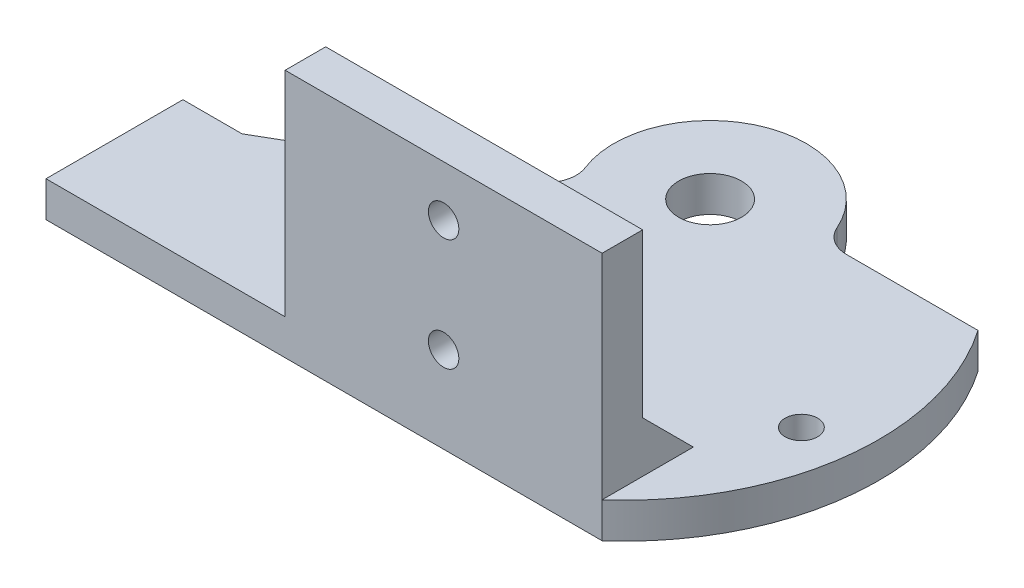
ISO-10303-21;
HEADER;
FILE_DESCRIPTION(('STEP AP214'),'2;1');
FILE_NAME('part.step','',(''),(''),'','','');
FILE_SCHEMA(('AUTOMOTIVE_DESIGN { 1 0 10303 214 1 1 1 1 }'));
ENDSEC;
DATA;
#1=APPLICATION_CONTEXT('core data for automotive mechanical design processes');
#2=APPLICATION_PROTOCOL_DEFINITION('international standard','automotive_design',2000,#1);
#3=PRODUCT_CONTEXT('',#1,'mechanical');
#4=PRODUCT('Part','Part','',(#3));
#5=PRODUCT_RELATED_PRODUCT_CATEGORY('part','',(#4));
#6=PRODUCT_DEFINITION_FORMATION('','',#4);
#7=PRODUCT_DEFINITION_CONTEXT('part definition',#1,'design');
#8=PRODUCT_DEFINITION('design','',#6,#7);
#9=PRODUCT_DEFINITION_SHAPE('','',#8);
#10=(LENGTH_UNIT() NAMED_UNIT(*) SI_UNIT(.MILLI.,.METRE.));
#11=(NAMED_UNIT(*) PLANE_ANGLE_UNIT() SI_UNIT($,.RADIAN.));
#12=(NAMED_UNIT(*) SI_UNIT($,.STERADIAN.) SOLID_ANGLE_UNIT());
#13=UNCERTAINTY_MEASURE_WITH_UNIT(LENGTH_MEASURE(1.E-05),#10,'distance_accuracy_value','');
#14=(GEOMETRIC_REPRESENTATION_CONTEXT(3) GLOBAL_UNCERTAINTY_ASSIGNED_CONTEXT((#13)) GLOBAL_UNIT_ASSIGNED_CONTEXT((#10,
#11,#12)) REPRESENTATION_CONTEXT('',''));
#15=CARTESIAN_POINT('',(0.,0.,0.));
#16=DIRECTION('',(0.,0.,1.));
#17=DIRECTION('',(1.,0.,0.));
#18=AXIS2_PLACEMENT_3D('',#15,#16,#17);
#19=CARTESIAN_POINT('',(20.3496,17.,13.5));
#20=DIRECTION('',(0.,0.,-1.));
#21=DIRECTION('',(1.,0.,0.));
#22=AXIS2_PLACEMENT_3D('',#19,#20,#21);
#23=PLANE('',#22);
#24=CARTESIAN_POINT('',(4.72198433686638,22.,13.5));
#25=DIRECTION('',(0.,0.,1.));
#26=DIRECTION('',(1.,0.,0.));
#27=AXIS2_PLACEMENT_3D('',#24,#25,#26);
#28=CIRCLE('',#27,1.5);
#29=CARTESIAN_POINT('',(6.22198433686639,22.,13.5));
#30=VERTEX_POINT('',#29);
#31=EDGE_CURVE('E361',#30,#30,#28,.T.);
#32=ORIENTED_EDGE('',*,*,#31,.F.);
#33=EDGE_LOOP('',(#32));
#34=FACE_BOUND('',#33,.T.);
#35=CARTESIAN_POINT('',(4.72198433686638,33.0559630595284,13.5));
#36=DIRECTION('',(0.,0.,1.));
#37=DIRECTION('',(1.,0.,0.));
#38=AXIS2_PLACEMENT_3D('',#35,#36,#37);
#39=CIRCLE('',#38,1.5);
#40=CARTESIAN_POINT('',(6.22198433686638,33.0559630595284,13.5));
#41=VERTEX_POINT('',#40);
#42=EDGE_CURVE('E351',#41,#41,#39,.T.);
#43=ORIENTED_EDGE('',*,*,#42,.F.);
#44=EDGE_LOOP('',(#43));
#45=FACE_BOUND('',#44,.T.);
#46=DIRECTION('',(1.,0.,0.));
#47=VECTOR('',#46,1.);
#48=CARTESIAN_POINT('',(20.3496,17.,13.5));
#49=LINE('',#48,#47);
#50=CARTESIAN_POINT('',(-34.4868,17.,13.5));
#51=VERTEX_POINT('',#50);
#52=CARTESIAN_POINT('',(-10.9056313262672,17.,13.5));
#53=VERTEX_POINT('',#52);
#54=EDGE_CURVE('E286',#51,#53,#49,.T.);
#55=ORIENTED_EDGE('',*,*,#54,.F.);
#56=DIRECTION('',(0.,-1.,0.));
#57=VECTOR('',#56,1.);
#58=CARTESIAN_POINT('',(-34.4868,17.,13.5));
#59=LINE('',#58,#57);
#60=CARTESIAN_POINT('',(-34.4868,13.5,13.5));
#61=VERTEX_POINT('',#60);
#62=EDGE_CURVE('E12',#51,#61,#59,.T.);
#63=ORIENTED_EDGE('',*,*,#62,.T.);
#64=DIRECTION('',(-1.,0.,0.));
#65=VECTOR('',#64,1.);
#66=CARTESIAN_POINT('',(20.3496,13.5,13.5));
#67=LINE('',#66,#65);
#68=CARTESIAN_POINT('',(20.3496,13.5,13.5));
#69=VERTEX_POINT('',#68);
#70=EDGE_CURVE('E172',#69,#61,#67,.T.);
#71=ORIENTED_EDGE('',*,*,#70,.F.);
#72=DIRECTION('',(0.,-1.,0.));
#73=VECTOR('',#72,1.);
#74=CARTESIAN_POINT('',(20.3496,17.,13.5));
#75=LINE('',#74,#73);
#76=CARTESIAN_POINT('',(20.3496,17.,13.5));
#77=VERTEX_POINT('',#76);
#78=EDGE_CURVE('E171',#77,#69,#75,.T.);
#79=ORIENTED_EDGE('',*,*,#78,.F.);
#80=DIRECTION('',(0.,-1.,0.));
#81=VECTOR('',#80,1.);
#82=CARTESIAN_POINT('',(20.3496,38.0559630595284,13.5));
#83=LINE('',#82,#81);
#84=CARTESIAN_POINT('',(20.3496,38.0559630595284,13.5));
#85=VERTEX_POINT('',#84);
#86=EDGE_CURVE('E318',#85,#77,#83,.T.);
#87=ORIENTED_EDGE('',*,*,#86,.F.);
#88=DIRECTION('',(1.,0.,0.));
#89=VECTOR('',#88,1.);
#90=CARTESIAN_POINT('',(-34.4868,38.0559630595284,13.5));
#91=LINE('',#90,#89);
#92=CARTESIAN_POINT('',(-10.9056313262672,38.0559630595284,13.5));
#93=VERTEX_POINT('',#92);
#94=EDGE_CURVE('E323',#93,#85,#91,.T.);
#95=ORIENTED_EDGE('',*,*,#94,.F.);
#96=DIRECTION('',(0.,1.,0.));
#97=VECTOR('',#96,1.);
#98=CARTESIAN_POINT('',(-10.9056313262672,17.,13.5));
#99=LINE('',#98,#97);
#100=EDGE_CURVE('E327',#53,#93,#99,.T.);
#101=ORIENTED_EDGE('',*,*,#100,.F.);
#102=EDGE_LOOP('',(#55,#63,#71,#79,#87,#95,#101));
#103=FACE_BOUND('',#102,.T.);
#104=ADVANCED_FACE('F35',(#34,#45,#103),#23,.F.);
#105=CARTESIAN_POINT('',(-34.4868,17.,13.5));
#106=DIRECTION('',(1.,0.,0.));
#107=DIRECTION('',(0.,0.,1.));
#108=AXIS2_PLACEMENT_3D('',#105,#106,#107);
#109=PLANE('',#108);
#110=DIRECTION('',(0.,0.,-1.));
#111=VECTOR('',#110,1.);
#112=CARTESIAN_POINT('',(-34.4868,17.,13.5));
#113=LINE('',#112,#111);
#114=CARTESIAN_POINT('',(-34.4868,17.,0.));
#115=VERTEX_POINT('',#114);
#116=EDGE_CURVE('E38',#51,#115,#113,.T.);
#117=ORIENTED_EDGE('',*,*,#116,.T.);
#118=DIRECTION('',(0.,-1.,0.));
#119=VECTOR('',#118,1.);
#120=CARTESIAN_POINT('',(-34.4868,17.,0.));
#121=LINE('',#120,#119);
#122=CARTESIAN_POINT('',(-34.4868,13.5,0.));
#123=VERTEX_POINT('',#122);
#124=EDGE_CURVE('E44',#115,#123,#121,.T.);
#125=ORIENTED_EDGE('',*,*,#124,.T.);
#126=DIRECTION('',(0.,0.,-1.));
#127=VECTOR('',#126,1.);
#128=CARTESIAN_POINT('',(-34.4868,13.5,13.5));
#129=LINE('',#128,#127);
#130=EDGE_CURVE('E174',#61,#123,#129,.T.);
#131=ORIENTED_EDGE('',*,*,#130,.F.);
#132=ORIENTED_EDGE('',*,*,#62,.F.);
#133=EDGE_LOOP('',(#117,#125,#131,#132));
#134=FACE_BOUND('',#133,.T.);
#135=ADVANCED_FACE('F280',(#134),#109,.F.);
#136=CARTESIAN_POINT('',(-34.4868,17.,0.));
#137=DIRECTION('',(0.,0.,1.));
#138=DIRECTION('',(-1.,0.,0.));
#139=AXIS2_PLACEMENT_3D('',#136,#137,#138);
#140=PLANE('',#139);
#141=DIRECTION('',(1.,0.,0.));
#142=VECTOR('',#141,1.);
#143=CARTESIAN_POINT('',(-34.4868,13.5,0.));
#144=LINE('',#143,#142);
#145=CARTESIAN_POINT('',(-28.6613749786786,13.5,0.));
#146=VERTEX_POINT('',#145);
#147=EDGE_CURVE('E178',#123,#146,#144,.T.);
#148=ORIENTED_EDGE('',*,*,#147,.F.);
#149=ORIENTED_EDGE('',*,*,#124,.F.);
#150=DIRECTION('',(1.,0.,0.));
#151=VECTOR('',#150,1.);
#152=CARTESIAN_POINT('',(-34.4868,17.,0.));
#153=LINE('',#152,#151);
#154=CARTESIAN_POINT('',(-28.6613749786786,17.,0.));
#155=VERTEX_POINT('',#154);
#156=EDGE_CURVE('E114',#115,#155,#153,.T.);
#157=ORIENTED_EDGE('',*,*,#156,.T.);
#158=DIRECTION('',(0.,-1.,0.));
#159=VECTOR('',#158,1.);
#160=CARTESIAN_POINT('',(-28.6613749786786,17.,0.));
#161=LINE('',#160,#159);
#162=EDGE_CURVE('E220',#155,#146,#161,.T.);
#163=ORIENTED_EDGE('',*,*,#162,.T.);
#164=EDGE_LOOP('',(#148,#149,#157,#163));
#165=FACE_BOUND('',#164,.T.);
#166=ADVANCED_FACE('F276',(#165),#140,.F.);
#167=CARTESIAN_POINT('',(-28.6613749786786,17.,0.));
#168=DIRECTION('',(0.500442701800588,0.,0.865769658866911));
#169=DIRECTION('',(-0.865769658866911,0.,0.500442701800588));
#170=AXIS2_PLACEMENT_3D('',#167,#168,#169);
#171=PLANE('',#170);
#172=DIRECTION('',(0.865769658866911,0.,-0.500442701800588));
#173=VECTOR('',#172,1.);
#174=CARTESIAN_POINT('',(-28.6613749786786,13.5,0.));
#175=LINE('',#174,#173);
#176=CARTESIAN_POINT('',(-24.6424002082218,13.5,-2.32309664816397));
#177=VERTEX_POINT('',#176);
#178=EDGE_CURVE('E181',#146,#177,#175,.T.);
#179=ORIENTED_EDGE('',*,*,#178,.F.);
#180=ORIENTED_EDGE('',*,*,#162,.F.);
#181=DIRECTION('',(0.865769658866911,0.,-0.500442701800588));
#182=VECTOR('',#181,1.);
#183=CARTESIAN_POINT('',(-28.6613749786786,17.,0.));
#184=LINE('',#183,#182);
#185=CARTESIAN_POINT('',(-24.6424002082218,17.,-2.32309664816397));
#186=VERTEX_POINT('',#185);
#187=EDGE_CURVE('E250',#155,#186,#184,.T.);
#188=ORIENTED_EDGE('',*,*,#187,.T.);
#189=DIRECTION('',(0.,-1.,0.));
#190=VECTOR('',#189,1.);
#191=CARTESIAN_POINT('',(-24.6424002082218,17.,-2.32309664816397));
#192=LINE('',#191,#190);
#193=EDGE_CURVE('E217',#186,#177,#192,.T.);
#194=ORIENTED_EDGE('',*,*,#193,.T.);
#195=EDGE_LOOP('',(#179,#180,#188,#194));
#196=FACE_BOUND('',#195,.T.);
#197=ADVANCED_FACE('F274',(#196),#171,.F.);
#198=CARTESIAN_POINT('',(-18.6805102122051,17.,-1.64791691254111));
#199=DIRECTION('',(0.,-1.,0.));
#200=DIRECTION('',(0.,0.,1.));
#201=AXIS2_PLACEMENT_3D('',#198,#199,#200);
#202=CYLINDRICAL_SURFACE('',#201,6.);
#203=CARTESIAN_POINT('',(-18.6805102122051,13.5,-1.64791691254111));
#204=DIRECTION('',(0.,-1.,0.));
#205=DIRECTION('',(0.,0.,-1.));
#206=AXIS2_PLACEMENT_3D('',#203,#204,#205);
#207=CIRCLE('',#206,6.);
#208=CARTESIAN_POINT('',(-16.8299633080181,13.5,-7.35540989592743));
#209=VERTEX_POINT('',#208);
#210=EDGE_CURVE('E184',#177,#209,#207,.T.);
#211=ORIENTED_EDGE('',*,*,#210,.F.);
#212=ORIENTED_EDGE('',*,*,#193,.F.);
#213=CARTESIAN_POINT('',(-18.6805102122051,17.,-1.64791691254111));
#214=DIRECTION('',(0.,-1.,0.));
#215=DIRECTION('',(0.,0.,-1.));
#216=AXIS2_PLACEMENT_3D('',#213,#214,#215);
#217=CIRCLE('',#216,6.);
#218=CARTESIAN_POINT('',(-16.8299633080181,17.,-7.35540989592743));
#219=VERTEX_POINT('',#218);
#220=EDGE_CURVE('E253',#186,#219,#217,.T.);
#221=ORIENTED_EDGE('',*,*,#220,.T.);
#222=DIRECTION('',(0.,-1.,0.));
#223=VECTOR('',#222,1.);
#224=CARTESIAN_POINT('',(-16.8299633080181,17.,-7.35540989592743));
#225=LINE('',#224,#223);
#226=EDGE_CURVE('E214',#219,#209,#225,.T.);
#227=ORIENTED_EDGE('',*,*,#226,.T.);
#228=EDGE_LOOP('',(#211,#212,#221,#227));
#229=FACE_BOUND('',#228,.T.);
#230=ADVANCED_FACE('F271',(#229),#202,.T.);
#231=CARTESIAN_POINT('',(-16.8299633080181,17.,-7.35540989592743));
#232=DIRECTION('',(0.233748216217537,0.,0.972297162093524));
#233=DIRECTION('',(-0.972297162093524,0.,0.233748216217537));
#234=AXIS2_PLACEMENT_3D('',#231,#232,#233);
#235=PLANE('',#234);
#236=DIRECTION('',(0.972297162093524,0.,-0.233748216217537));
#237=VECTOR('',#236,1.);
#238=CARTESIAN_POINT('',(-16.8299633080181,13.5,-7.35540989592743));
#239=LINE('',#238,#237);
#240=CARTESIAN_POINT('',(-11.7523069819295,13.5,-8.57612014281668));
#241=VERTEX_POINT('',#240);
#242=EDGE_CURVE('E187',#209,#241,#239,.T.);
#243=ORIENTED_EDGE('',*,*,#242,.F.);
#244=ORIENTED_EDGE('',*,*,#226,.F.);
#245=DIRECTION('',(0.972297162093524,0.,-0.233748216217537));
#246=VECTOR('',#245,1.);
#247=CARTESIAN_POINT('',(-16.8299633080181,17.,-7.35540989592743));
#248=LINE('',#247,#246);
#249=CARTESIAN_POINT('',(-11.7523069819295,17.,-8.57612014281668));
#250=VERTEX_POINT('',#249);
#251=EDGE_CURVE('E256',#219,#250,#248,.T.);
#252=ORIENTED_EDGE('',*,*,#251,.T.);
#253=DIRECTION('',(0.,-1.,0.));
#254=VECTOR('',#253,1.);
#255=CARTESIAN_POINT('',(-11.7523069819295,17.,-8.57612014281668));
#256=LINE('',#255,#254);
#257=EDGE_CURVE('E211',#250,#241,#256,.T.);
#258=ORIENTED_EDGE('',*,*,#257,.T.);
#259=EDGE_LOOP('',(#243,#244,#252,#258));
#260=FACE_BOUND('',#259,.T.);
#261=ADVANCED_FACE('F268',(#260),#235,.F.);
#262=CARTESIAN_POINT('',(-11.7523069819295,17.,-8.57612014281668));
#263=DIRECTION('',(0.707106781186547,0.,0.707106781186548));
#264=DIRECTION('',(-0.707106781186548,0.,0.707106781186547));
#265=AXIS2_PLACEMENT_3D('',#262,#263,#264);
#266=PLANE('',#265);
#267=DIRECTION('',(0.707106781186548,0.,-0.707106781186547));
#268=VECTOR('',#267,1.);
#269=CARTESIAN_POINT('',(-11.7523069819295,13.5,-8.57612014281668));
#270=LINE('',#269,#268);
#271=CARTESIAN_POINT('',(-9.51513943538292,13.5,-10.8132876893633));
#272=VERTEX_POINT('',#271);
#273=EDGE_CURVE('E190',#241,#272,#270,.T.);
#274=ORIENTED_EDGE('',*,*,#273,.F.);
#275=ORIENTED_EDGE('',*,*,#257,.F.);
#276=DIRECTION('',(0.707106781186548,0.,-0.707106781186547));
#277=VECTOR('',#276,1.);
#278=CARTESIAN_POINT('',(-11.7523069819295,17.,-8.57612014281668));
#279=LINE('',#278,#277);
#280=CARTESIAN_POINT('',(-9.51513943538292,17.,-10.8132876893633));
#281=VERTEX_POINT('',#280);
#282=EDGE_CURVE('E165',#250,#281,#279,.T.);
#283=ORIENTED_EDGE('',*,*,#282,.T.);
#284=DIRECTION('',(0.,-1.,0.));
#285=VECTOR('',#284,1.);
#286=CARTESIAN_POINT('',(-9.51513943538292,17.,-10.8132876893633));
#287=LINE('',#286,#285);
#288=EDGE_CURVE('E208',#281,#272,#287,.T.);
#289=ORIENTED_EDGE('',*,*,#288,.T.);
#290=EDGE_LOOP('',(#274,#275,#283,#289));
#291=FACE_BOUND('',#290,.T.);
#292=ADVANCED_FACE('F261',(#291),#266,.F.);
#293=CARTESIAN_POINT('',(-11.6364597789426,17.,-12.9346080329229));
#294=DIRECTION('',(0.,-1.,0.));
#295=DIRECTION('',(0.,0.,1.));
#296=AXIS2_PLACEMENT_3D('',#293,#294,#295);
#297=CYLINDRICAL_SURFACE('',#296,3.);
#298=CARTESIAN_POINT('',(-11.6364597789426,13.5,-12.9346080329229));
#299=DIRECTION('',(0.,1.,0.));
#300=DIRECTION('',(0.,0.,-1.));
#301=AXIS2_PLACEMENT_3D('',#298,#299,#300);
#302=CIRCLE('',#301,3.);
#303=CARTESIAN_POINT('',(-8.84370943199635,13.5,-14.0303021050214));
#304=VERTEX_POINT('',#303);
#305=EDGE_CURVE('E193',#272,#304,#302,.T.);
#306=ORIENTED_EDGE('',*,*,#305,.F.);
#307=ORIENTED_EDGE('',*,*,#288,.F.);
#308=CARTESIAN_POINT('',(-11.6364597789426,17.,-12.9346080329229));
#309=DIRECTION('',(0.,1.,0.));
#310=DIRECTION('',(0.,0.,-1.));
#311=AXIS2_PLACEMENT_3D('',#308,#309,#310);
#312=CIRCLE('',#311,3.);
#313=CARTESIAN_POINT('',(-8.84370943199635,17.,-14.0303021050214));
#314=VERTEX_POINT('',#313);
#315=EDGE_CURVE('E163',#281,#314,#312,.T.);
#316=ORIENTED_EDGE('',*,*,#315,.T.);
#317=DIRECTION('',(0.,-1.,0.));
#318=VECTOR('',#317,1.);
#319=CARTESIAN_POINT('',(-8.84370943199635,17.,-14.0303021050214));
#320=LINE('',#319,#318);
#321=EDGE_CURVE('E157',#314,#304,#320,.T.);
#322=ORIENTED_EDGE('',*,*,#321,.T.);
#323=EDGE_LOOP('',(#306,#307,#316,#322));
#324=FACE_BOUND('',#323,.T.);
#325=ADVANCED_FACE('F265',(#324),#297,.F.);
#326=CARTESIAN_POINT('',(0.,17.,-17.5));
#327=DIRECTION('',(0.,-1.,0.));
#328=DIRECTION('',(0.,0.,1.));
#329=AXIS2_PLACEMENT_3D('',#326,#327,#328);
#330=CYLINDRICAL_SURFACE('',#329,9.5);
#331=CARTESIAN_POINT('',(0.,13.5,-17.5));
#332=DIRECTION('',(0.,-1.,0.));
#333=DIRECTION('',(0.,0.,-1.));
#334=AXIS2_PLACEMENT_3D('',#331,#332,#333);
#335=CIRCLE('',#334,9.5);
#336=CARTESIAN_POINT('',(8.7068938204161,13.5,-21.3));
#337=VERTEX_POINT('',#336);
#338=EDGE_CURVE('E196',#304,#337,#335,.T.);
#339=ORIENTED_EDGE('',*,*,#338,.F.);
#340=ORIENTED_EDGE('',*,*,#321,.F.);
#341=CARTESIAN_POINT('',(0.,17.,-17.5));
#342=DIRECTION('',(0.,-1.,0.));
#343=DIRECTION('',(0.,0.,-1.));
#344=AXIS2_PLACEMENT_3D('',#341,#342,#343);
#345=CIRCLE('',#344,9.5);
#346=CARTESIAN_POINT('',(8.7068938204161,17.,-21.3));
#347=VERTEX_POINT('',#346);
#348=EDGE_CURVE('E142',#314,#347,#345,.T.);
#349=ORIENTED_EDGE('',*,*,#348,.T.);
#350=DIRECTION('',(0.,-1.,0.));
#351=VECTOR('',#350,1.);
#352=CARTESIAN_POINT('',(8.7068938204161,17.,-21.3));
#353=LINE('',#352,#351);
#354=EDGE_CURVE('E151',#347,#337,#353,.T.);
#355=ORIENTED_EDGE('',*,*,#354,.T.);
#356=EDGE_LOOP('',(#339,#340,#349,#355));
#357=FACE_BOUND('',#356,.T.);
#358=ADVANCED_FACE('F160',(#357),#330,.T.);
#359=CARTESIAN_POINT('',(11.4564392373896,17.,-22.5));
#360=DIRECTION('',(0.,-1.,0.));
#361=DIRECTION('',(0.,0.,1.));
#362=AXIS2_PLACEMENT_3D('',#359,#360,#361);
#363=CYLINDRICAL_SURFACE('',#362,3.);
#364=CARTESIAN_POINT('',(11.4564392373896,13.5,-22.5));
#365=DIRECTION('',(0.,1.,0.));
#366=DIRECTION('',(0.,0.,-1.));
#367=AXIS2_PLACEMENT_3D('',#364,#365,#366);
#368=CIRCLE('',#367,3.);
#369=CARTESIAN_POINT('',(11.4564392373896,13.5,-19.5));
#370=VERTEX_POINT('',#369);
#371=EDGE_CURVE('E154',#337,#370,#368,.T.);
#372=ORIENTED_EDGE('',*,*,#371,.F.);
#373=ORIENTED_EDGE('',*,*,#354,.F.);
#374=CARTESIAN_POINT('',(11.4564392373896,17.,-22.5));
#375=DIRECTION('',(0.,1.,0.));
#376=DIRECTION('',(0.,0.,-1.));
#377=AXIS2_PLACEMENT_3D('',#374,#375,#376);
#378=CIRCLE('',#377,3.);
#379=CARTESIAN_POINT('',(11.4564392373896,17.,-19.5));
#380=VERTEX_POINT('',#379);
#381=EDGE_CURVE('E137',#347,#380,#378,.T.);
#382=ORIENTED_EDGE('',*,*,#381,.T.);
#383=DIRECTION('',(0.,-1.,0.));
#384=VECTOR('',#383,1.);
#385=CARTESIAN_POINT('',(11.4564392373896,17.,-19.5));
#386=LINE('',#385,#384);
#387=EDGE_CURVE('E158',#380,#370,#386,.T.);
#388=ORIENTED_EDGE('',*,*,#387,.T.);
#389=EDGE_LOOP('',(#372,#373,#382,#388));
#390=FACE_BOUND('',#389,.T.);
#391=ADVANCED_FACE('F152',(#390),#363,.F.);
#392=CARTESIAN_POINT('',(11.4564392373896,17.,-19.5));
#393=DIRECTION('',(0.,0.,1.));
#394=DIRECTION('',(-1.,0.,0.));
#395=AXIS2_PLACEMENT_3D('',#392,#393,#394);
#396=PLANE('',#395);
#397=DIRECTION('',(1.,0.,0.));
#398=VECTOR('',#397,1.);
#399=CARTESIAN_POINT('',(11.4564392373896,13.5,-19.5));
#400=LINE('',#399,#398);
#401=CARTESIAN_POINT('',(24.4182308941496,13.5,-19.5));
#402=VERTEX_POINT('',#401);
#403=EDGE_CURVE('E199',#370,#402,#400,.T.);
#404=ORIENTED_EDGE('',*,*,#403,.F.);
#405=ORIENTED_EDGE('',*,*,#387,.F.);
#406=DIRECTION('',(1.,0.,0.));
#407=VECTOR('',#406,1.);
#408=CARTESIAN_POINT('',(11.4564392373896,17.,-19.5));
#409=LINE('',#408,#407);
#410=CARTESIAN_POINT('',(24.4182308941496,17.,-19.5));
#411=VERTEX_POINT('',#410);
#412=EDGE_CURVE('E145',#380,#411,#409,.T.);
#413=ORIENTED_EDGE('',*,*,#412,.T.);
#414=DIRECTION('',(0.,-1.,0.));
#415=VECTOR('',#414,1.);
#416=CARTESIAN_POINT('',(24.4182308941496,17.,-19.5));
#417=LINE('',#416,#415);
#418=EDGE_CURVE('E203',#411,#402,#417,.T.);
#419=ORIENTED_EDGE('',*,*,#418,.T.);
#420=EDGE_LOOP('',(#404,#405,#413,#419));
#421=FACE_BOUND('',#420,.T.);
#422=ADVANCED_FACE('F436',(#421),#396,.F.);
#423=CARTESIAN_POINT('',(3.8530842496332,17.,-5.28470037285398));
#424=DIRECTION('',(0.,-1.,0.));
#425=DIRECTION('',(0.,0.,1.));
#426=AXIS2_PLACEMENT_3D('',#423,#424,#425);
#427=CYLINDRICAL_SURFACE('',#426,25.);
#428=CARTESIAN_POINT('',(3.8530842496332,13.5,-5.28470037285398));
#429=DIRECTION('',(0.,-1.,0.));
#430=DIRECTION('',(0.,0.,-1.));
#431=AXIS2_PLACEMENT_3D('',#428,#429,#430);
#432=CIRCLE('',#431,25.);
#433=EDGE_CURVE('E106',#402,#69,#432,.T.);
#434=ORIENTED_EDGE('',*,*,#433,.F.);
#435=ORIENTED_EDGE('',*,*,#418,.F.);
#436=CARTESIAN_POINT('',(3.8530842496332,17.,-5.28470037285398));
#437=DIRECTION('',(0.,-1.,0.));
#438=DIRECTION('',(0.,0.,-1.));
#439=AXIS2_PLACEMENT_3D('',#436,#437,#438);
#440=CIRCLE('',#439,25.);
#441=EDGE_CURVE('E61',#411,#77,#440,.T.);
#442=ORIENTED_EDGE('',*,*,#441,.T.);
#443=ORIENTED_EDGE('',*,*,#78,.T.);
#444=EDGE_LOOP('',(#434,#435,#442,#443));
#445=FACE_BOUND('',#444,.T.);
#446=ADVANCED_FACE('F314',(#445),#427,.T.);
#447=CARTESIAN_POINT('',(-18.6805102122051,17.,-1.64791691254111));
#448=DIRECTION('',(0.,1.,0.));
#449=DIRECTION('',(0.,0.,-1.));
#450=AXIS2_PLACEMENT_3D('',#447,#448,#449);
#451=PLANE('',#450);
#452=DIRECTION('',(0.,0.,1.));
#453=VECTOR('',#452,1.);
#454=CARTESIAN_POINT('',(20.3496,17.,9.49999999999999));
#455=LINE('',#454,#453);
#456=CARTESIAN_POINT('',(20.3496,17.,4.49999999999999));
#457=VERTEX_POINT('',#456);
#458=EDGE_CURVE('E239',#457,#77,#455,.T.);
#459=ORIENTED_EDGE('',*,*,#458,.T.);
#460=ORIENTED_EDGE('',*,*,#441,.F.);
#461=ORIENTED_EDGE('',*,*,#412,.F.);
#462=ORIENTED_EDGE('',*,*,#381,.F.);
#463=ORIENTED_EDGE('',*,*,#348,.F.);
#464=ORIENTED_EDGE('',*,*,#315,.F.);
#465=ORIENTED_EDGE('',*,*,#282,.F.);
#466=ORIENTED_EDGE('',*,*,#251,.F.);
#467=ORIENTED_EDGE('',*,*,#220,.F.);
#468=ORIENTED_EDGE('',*,*,#187,.F.);
#469=ORIENTED_EDGE('',*,*,#156,.F.);
#470=ORIENTED_EDGE('',*,*,#116,.F.);
#471=ORIENTED_EDGE('',*,*,#54,.T.);
#472=DIRECTION('',(0.,0.,-1.));
#473=VECTOR('',#472,1.);
#474=CARTESIAN_POINT('',(-10.9056313262672,17.,19.5));
#475=LINE('',#474,#473);
#476=CARTESIAN_POINT('',(-10.9056313262672,17.,4.49999999999999));
#477=VERTEX_POINT('',#476);
#478=EDGE_CURVE('E332',#53,#477,#475,.T.);
#479=ORIENTED_EDGE('',*,*,#478,.T.);
#480=DIRECTION('',(-1.,0.,0.));
#481=VECTOR('',#480,1.);
#482=CARTESIAN_POINT('',(27.4206678118655,17.,4.49999999999999));
#483=LINE('',#482,#481);
#484=EDGE_CURVE('E311',#457,#477,#483,.T.);
#485=ORIENTED_EDGE('',*,*,#484,.F.);
#486=EDGE_LOOP('',(#459,#460,#461,#462,#463,#464,#465,#466,#467,#468,#469,#470,#471,#479,#485));
#487=FACE_BOUND('',#486,.T.);
#488=CARTESIAN_POINT('',(0.,17.,-17.5));
#489=DIRECTION('',(0.,-1.,0.));
#490=DIRECTION('',(0.,0.,-1.));
#491=AXIS2_PLACEMENT_3D('',#488,#489,#490);
#492=CIRCLE('',#491,3.1);
#493=CARTESIAN_POINT('',(0.,17.,-20.6));
#494=VERTEX_POINT('',#493);
#495=EDGE_CURVE('E233',#494,#494,#492,.T.);
#496=ORIENTED_EDGE('',*,*,#495,.T.);
#497=EDGE_LOOP('',(#496));
#498=FACE_BOUND('',#497,.T.);
#499=CARTESIAN_POINT('',(-20.,17.,-2.50000000000001));
#500=DIRECTION('',(0.,-1.,0.));
#501=DIRECTION('',(0.,0.,-1.));
#502=AXIS2_PLACEMENT_3D('',#499,#500,#501);
#503=CIRCLE('',#502,1.6);
#504=CARTESIAN_POINT('',(-20.,17.,-4.10000000000001));
#505=VERTEX_POINT('',#504);
#506=EDGE_CURVE('E228',#505,#505,#503,.T.);
#507=ORIENTED_EDGE('',*,*,#506,.T.);
#508=EDGE_LOOP('',(#507));
#509=FACE_BOUND('',#508,.T.);
#510=CARTESIAN_POINT('',(24.,17.,-2.50000000000001));
#511=DIRECTION('',(0.,-1.,0.));
#512=DIRECTION('',(0.,0.,-1.));
#513=AXIS2_PLACEMENT_3D('',#510,#511,#512);
#514=CIRCLE('',#513,1.6);
#515=CARTESIAN_POINT('',(24.,17.,-4.10000000000001));
#516=VERTEX_POINT('',#515);
#517=EDGE_CURVE('E232',#516,#516,#514,.T.);
#518=ORIENTED_EDGE('',*,*,#517,.T.);
#519=EDGE_LOOP('',(#518));
#520=FACE_BOUND('',#519,.T.);
#521=ADVANCED_FACE('F139',(#487,#498,#509,#520),#451,.T.);
#522=CARTESIAN_POINT('',(-18.6805102122051,13.5,-1.64791691254111));
#523=DIRECTION('',(0.,1.,0.));
#524=DIRECTION('',(0.,0.,-1.));
#525=AXIS2_PLACEMENT_3D('',#522,#523,#524);
#526=PLANE('',#525);
#527=CARTESIAN_POINT('',(0.,13.5,-17.5));
#528=DIRECTION('',(0.,-1.,0.));
#529=DIRECTION('',(0.,0.,-1.));
#530=AXIS2_PLACEMENT_3D('',#527,#528,#529);
#531=CIRCLE('',#530,3.1);
#532=CARTESIAN_POINT('',(0.,13.5,-20.6));
#533=VERTEX_POINT('',#532);
#534=EDGE_CURVE('E230',#533,#533,#531,.T.);
#535=ORIENTED_EDGE('',*,*,#534,.F.);
#536=EDGE_LOOP('',(#535));
#537=FACE_BOUND('',#536,.T.);
#538=CARTESIAN_POINT('',(-20.,13.5,-2.50000000000001));
#539=DIRECTION('',(0.,-1.,0.));
#540=DIRECTION('',(0.,0.,-1.));
#541=AXIS2_PLACEMENT_3D('',#538,#539,#540);
#542=CIRCLE('',#541,1.6);
#543=CARTESIAN_POINT('',(-20.,13.5,-4.10000000000001));
#544=VERTEX_POINT('',#543);
#545=EDGE_CURVE('E175',#544,#544,#542,.T.);
#546=ORIENTED_EDGE('',*,*,#545,.F.);
#547=EDGE_LOOP('',(#546));
#548=FACE_BOUND('',#547,.T.);
#549=CARTESIAN_POINT('',(24.,13.5,-2.50000000000001));
#550=DIRECTION('',(0.,-1.,0.));
#551=DIRECTION('',(0.,0.,-1.));
#552=AXIS2_PLACEMENT_3D('',#549,#550,#551);
#553=CIRCLE('',#552,1.6);
#554=CARTESIAN_POINT('',(24.,13.5,-4.10000000000001));
#555=VERTEX_POINT('',#554);
#556=EDGE_CURVE('E225',#555,#555,#553,.T.);
#557=ORIENTED_EDGE('',*,*,#556,.F.);
#558=EDGE_LOOP('',(#557));
#559=FACE_BOUND('',#558,.T.);
#560=ORIENTED_EDGE('',*,*,#70,.T.);
#561=ORIENTED_EDGE('',*,*,#130,.T.);
#562=ORIENTED_EDGE('',*,*,#147,.T.);
#563=ORIENTED_EDGE('',*,*,#178,.T.);
#564=ORIENTED_EDGE('',*,*,#210,.T.);
#565=ORIENTED_EDGE('',*,*,#242,.T.);
#566=ORIENTED_EDGE('',*,*,#273,.T.);
#567=ORIENTED_EDGE('',*,*,#305,.T.);
#568=ORIENTED_EDGE('',*,*,#338,.T.);
#569=ORIENTED_EDGE('',*,*,#371,.T.);
#570=ORIENTED_EDGE('',*,*,#403,.T.);
#571=ORIENTED_EDGE('',*,*,#433,.T.);
#572=EDGE_LOOP('',(#560,#561,#562,#563,#564,#565,#566,#567,#568,#569,#570,#571));
#573=FACE_BOUND('',#572,.T.);
#574=ADVANCED_FACE('F266',(#537,#548,#559,#573),#526,.F.);
#575=CARTESIAN_POINT('',(24.,0.,-2.50000000000001));
#576=DIRECTION('',(0.,1.,0.));
#577=DIRECTION('',(0.,0.,-1.));
#578=AXIS2_PLACEMENT_3D('',#575,#576,#577);
#579=CYLINDRICAL_SURFACE('',#578,1.6);
#580=ORIENTED_EDGE('',*,*,#517,.F.);
#581=EDGE_LOOP('',(#580));
#582=FACE_BOUND('',#581,.T.);
#583=ORIENTED_EDGE('',*,*,#556,.T.);
#584=EDGE_LOOP('',(#583));
#585=FACE_BOUND('',#584,.T.);
#586=ADVANCED_FACE('F424',(#582,#585),#579,.F.);
#587=CARTESIAN_POINT('',(-20.,0.,-2.50000000000001));
#588=DIRECTION('',(0.,1.,0.));
#589=DIRECTION('',(0.,0.,-1.));
#590=AXIS2_PLACEMENT_3D('',#587,#588,#589);
#591=CYLINDRICAL_SURFACE('',#590,1.6);
#592=ORIENTED_EDGE('',*,*,#506,.F.);
#593=EDGE_LOOP('',(#592));
#594=FACE_BOUND('',#593,.T.);
#595=ORIENTED_EDGE('',*,*,#545,.T.);
#596=EDGE_LOOP('',(#595));
#597=FACE_BOUND('',#596,.T.);
#598=ADVANCED_FACE('F420',(#594,#597),#591,.F.);
#599=CARTESIAN_POINT('',(0.,12.,-17.5));
#600=DIRECTION('',(0.,1.,0.));
#601=DIRECTION('',(0.,0.,-1.));
#602=AXIS2_PLACEMENT_3D('',#599,#600,#601);
#603=CYLINDRICAL_SURFACE('',#602,3.1);
#604=ORIENTED_EDGE('',*,*,#495,.F.);
#605=EDGE_LOOP('',(#604));
#606=FACE_BOUND('',#605,.T.);
#607=ORIENTED_EDGE('',*,*,#534,.T.);
#608=EDGE_LOOP('',(#607));
#609=FACE_BOUND('',#608,.T.);
#610=ADVANCED_FACE('F415',(#606,#609),#603,.F.);
#611=CARTESIAN_POINT('',(20.3496,38.0559630595284,9.49999999999999));
#612=DIRECTION('',(1.,0.,0.));
#613=DIRECTION('',(0.,1.,0.));
#614=AXIS2_PLACEMENT_3D('',#611,#612,#613);
#615=PLANE('',#614);
#616=ORIENTED_EDGE('',*,*,#86,.T.);
#617=ORIENTED_EDGE('',*,*,#458,.F.);
#618=DIRECTION('',(0.,0.707106781186547,0.707106781186548));
#619=VECTOR('',#618,1.);
#620=CARTESIAN_POINT('',(20.3496,17.,4.49999999999999));
#621=LINE('',#620,#619);
#622=CARTESIAN_POINT('',(20.3496,22.,9.49999999999999));
#623=VERTEX_POINT('',#622);
#624=EDGE_CURVE('E373',#457,#623,#621,.T.);
#625=ORIENTED_EDGE('',*,*,#624,.T.);
#626=DIRECTION('',(0.,-1.,0.));
#627=VECTOR('',#626,1.);
#628=CARTESIAN_POINT('',(20.3496,38.0559630595284,9.49999999999999));
#629=LINE('',#628,#627);
#630=CARTESIAN_POINT('',(20.3496,38.0559630595284,9.49999999999999));
#631=VERTEX_POINT('',#630);
#632=EDGE_CURVE('E337',#631,#623,#629,.T.);
#633=ORIENTED_EDGE('',*,*,#632,.F.);
#634=DIRECTION('',(0.,0.,1.));
#635=VECTOR('',#634,1.);
#636=CARTESIAN_POINT('',(20.3496,38.0559630595284,9.49999999999999));
#637=LINE('',#636,#635);
#638=EDGE_CURVE('E242',#631,#85,#637,.T.);
#639=ORIENTED_EDGE('',*,*,#638,.T.);
#640=EDGE_LOOP('',(#616,#617,#625,#633,#639));
#641=FACE_BOUND('',#640,.T.);
#642=ADVANCED_FACE('F319',(#641),#615,.T.);
#643=CARTESIAN_POINT('',(-34.4868,38.0559630595284,9.49999999999999));
#644=DIRECTION('',(0.,1.,0.));
#645=DIRECTION('',(0.,0.,-1.));
#646=AXIS2_PLACEMENT_3D('',#643,#644,#645);
#647=PLANE('',#646);
#648=DIRECTION('',(0.,0.,-1.));
#649=VECTOR('',#648,1.);
#650=CARTESIAN_POINT('',(-10.9056313262672,38.0559630595284,19.5));
#651=LINE('',#650,#649);
#652=CARTESIAN_POINT('',(-10.9056313262672,38.0559630595284,9.49999999999999));
#653=VERTEX_POINT('',#652);
#654=EDGE_CURVE('E328',#93,#653,#651,.T.);
#655=ORIENTED_EDGE('',*,*,#654,.F.);
#656=ORIENTED_EDGE('',*,*,#94,.T.);
#657=ORIENTED_EDGE('',*,*,#638,.F.);
#658=DIRECTION('',(1.,0.,0.));
#659=VECTOR('',#658,1.);
#660=CARTESIAN_POINT('',(-34.4868,38.0559630595284,9.49999999999999));
#661=LINE('',#660,#659);
#662=EDGE_CURVE('E322',#653,#631,#661,.T.);
#663=ORIENTED_EDGE('',*,*,#662,.F.);
#664=EDGE_LOOP('',(#655,#656,#657,#663));
#665=FACE_BOUND('',#664,.T.);
#666=ADVANCED_FACE('F341',(#665),#647,.T.);
#667=CARTESIAN_POINT('',(0.,0.,9.49999999999999));
#668=DIRECTION('',(0.,0.,1.));
#669=DIRECTION('',(-1.,0.,0.));
#670=AXIS2_PLACEMENT_3D('',#667,#668,#669);
#671=PLANE('',#670);
#672=DIRECTION('',(0.,1.,0.));
#673=VECTOR('',#672,1.);
#674=CARTESIAN_POINT('',(-10.9056313262672,38.0559630595284,9.49999999999999));
#675=LINE('',#674,#673);
#676=CARTESIAN_POINT('',(-10.9056313262672,22.,9.49999999999999));
#677=VERTEX_POINT('',#676);
#678=EDGE_CURVE('E350',#677,#653,#675,.T.);
#679=ORIENTED_EDGE('',*,*,#678,.T.);
#680=ORIENTED_EDGE('',*,*,#662,.T.);
#681=ORIENTED_EDGE('',*,*,#632,.T.);
#682=DIRECTION('',(-1.,0.,0.));
#683=VECTOR('',#682,1.);
#684=CARTESIAN_POINT('',(27.4206678118655,22.,9.49999999999999));
#685=LINE('',#684,#683);
#686=CARTESIAN_POINT('',(6.22198433686639,22.,9.49999999999999));
#687=VERTEX_POINT('',#686);
#688=EDGE_CURVE('E368',#623,#687,#685,.T.);
#689=ORIENTED_EDGE('',*,*,#688,.T.);
#690=CARTESIAN_POINT('',(4.72198433686638,22.,9.49999999999999));
#691=DIRECTION('',(0.,0.,1.));
#692=DIRECTION('',(1.,0.,0.));
#693=AXIS2_PLACEMENT_3D('',#690,#691,#692);
#694=CIRCLE('',#693,1.5);
#695=CARTESIAN_POINT('',(3.22198433686638,22.,9.49999999999999));
#696=VERTEX_POINT('',#695);
#697=EDGE_CURVE('E364',#687,#696,#694,.T.);
#698=ORIENTED_EDGE('',*,*,#697,.T.);
#699=EDGE_CURVE('E371',#696,#677,#685,.T.);
#700=ORIENTED_EDGE('',*,*,#699,.T.);
#701=EDGE_LOOP('',(#679,#680,#681,#689,#698,#700));
#702=FACE_BOUND('',#701,.T.);
#703=CARTESIAN_POINT('',(4.72198433686638,33.0559630595284,9.49999999999999));
#704=DIRECTION('',(0.,0.,1.));
#705=DIRECTION('',(1.,0.,0.));
#706=AXIS2_PLACEMENT_3D('',#703,#704,#705);
#707=CIRCLE('',#706,1.5);
#708=CARTESIAN_POINT('',(6.22198433686638,33.0559630595284,9.49999999999999));
#709=VERTEX_POINT('',#708);
#710=EDGE_CURVE('E356',#709,#709,#707,.T.);
#711=ORIENTED_EDGE('',*,*,#710,.T.);
#712=EDGE_LOOP('',(#711));
#713=FACE_BOUND('',#712,.T.);
#714=ADVANCED_FACE('F379',(#702,#713),#671,.F.);
#715=CARTESIAN_POINT('',(-10.9056313262672,38.0559630595284,19.5));
#716=DIRECTION('',(1.,0.,0.));
#717=DIRECTION('',(0.,0.,1.));
#718=AXIS2_PLACEMENT_3D('',#715,#716,#717);
#719=PLANE('',#718);
#720=ORIENTED_EDGE('',*,*,#478,.F.);
#721=ORIENTED_EDGE('',*,*,#100,.T.);
#722=ORIENTED_EDGE('',*,*,#654,.T.);
#723=ORIENTED_EDGE('',*,*,#678,.F.);
#724=DIRECTION('',(0.,0.707106781186547,0.707106781186548));
#725=VECTOR('',#724,1.);
#726=CARTESIAN_POINT('',(-10.9056313262672,17.,4.49999999999999));
#727=LINE('',#726,#725);
#728=EDGE_CURVE('E349',#477,#677,#727,.T.);
#729=ORIENTED_EDGE('',*,*,#728,.F.);
#730=EDGE_LOOP('',(#720,#721,#722,#723,#729));
#731=FACE_BOUND('',#730,.T.);
#732=ADVANCED_FACE('F345',(#731),#719,.F.);
#733=CARTESIAN_POINT('',(4.72198433686638,33.0559630595284,19.5));
#734=DIRECTION('',(0.,0.,-1.));
#735=DIRECTION('',(1.,0.,0.));
#736=AXIS2_PLACEMENT_3D('',#733,#734,#735);
#737=CYLINDRICAL_SURFACE('',#736,1.5);
#738=ORIENTED_EDGE('',*,*,#710,.F.);
#739=EDGE_LOOP('',(#738));
#740=FACE_BOUND('',#739,.T.);
#741=ORIENTED_EDGE('',*,*,#42,.T.);
#742=EDGE_LOOP('',(#741));
#743=FACE_BOUND('',#742,.T.);
#744=ADVANCED_FACE('F393',(#740,#743),#737,.F.);
#745=CARTESIAN_POINT('',(4.72198433686638,22.,19.5));
#746=DIRECTION('',(0.,0.,-1.));
#747=DIRECTION('',(1.,0.,0.));
#748=AXIS2_PLACEMENT_3D('',#745,#746,#747);
#749=CYLINDRICAL_SURFACE('',#748,1.5);
#750=ORIENTED_EDGE('',*,*,#697,.F.);
#751=EDGE_CURVE('E367',#696,#687,#694,.T.);
#752=ORIENTED_EDGE('',*,*,#751,.F.);
#753=EDGE_LOOP('',(#750,#752));
#754=FACE_BOUND('',#753,.T.);
#755=ORIENTED_EDGE('',*,*,#31,.T.);
#756=EDGE_LOOP('',(#755));
#757=FACE_BOUND('',#756,.T.);
#758=ADVANCED_FACE('F386',(#754,#757),#749,.F.);
#759=CARTESIAN_POINT('',(27.4206678118655,22.,9.49999999999999));
#760=DIRECTION('',(0.,0.,1.));
#761=DIRECTION('',(-1.,0.,0.));
#762=AXIS2_PLACEMENT_3D('',#759,#760,#761);
#763=PLANE('',#762);
#764=ORIENTED_EDGE('',*,*,#751,.T.);
#765=EDGE_CURVE('E52',#687,#696,#685,.T.);
#766=ORIENTED_EDGE('',*,*,#765,.T.);
#767=EDGE_LOOP('',(#764,#766));
#768=FACE_BOUND('',#767,.T.);
#769=ADVANCED_FACE('F384',(#768),#763,.T.);
#770=CARTESIAN_POINT('',(27.4206678118655,17.,4.49999999999999));
#771=DIRECTION('',(0.,0.707106781186548,-0.707106781186547));
#772=DIRECTION('',(0.,-0.707106781186547,-0.707106781186548));
#773=AXIS2_PLACEMENT_3D('',#770,#771,#772);
#774=PLANE('',#773);
#775=ORIENTED_EDGE('',*,*,#484,.T.);
#776=ORIENTED_EDGE('',*,*,#728,.T.);
#777=ORIENTED_EDGE('',*,*,#699,.F.);
#778=ORIENTED_EDGE('',*,*,#765,.F.);
#779=ORIENTED_EDGE('',*,*,#688,.F.);
#780=ORIENTED_EDGE('',*,*,#624,.F.);
#781=EDGE_LOOP('',(#775,#776,#777,#778,#779,#780));
#782=FACE_BOUND('',#781,.T.);
#783=ADVANCED_FACE('F376',(#782),#774,.T.);
#784=CLOSED_SHELL('',(#104,#135,#166,#197,#230,#261,#292,#325,#358,#391,#422,#446,#521,#574,
#586,#598,#610,#642,#666,#714,#732,#744,#758,#769,#783));
#785=MANIFOLD_SOLID_BREP('B2',#784);
#786=ADVANCED_BREP_SHAPE_REPRESENTATION('',(#18,#785),#14);
#787=SHAPE_DEFINITION_REPRESENTATION(#9,#786);
ENDSEC;
END-ISO-10303-21;
